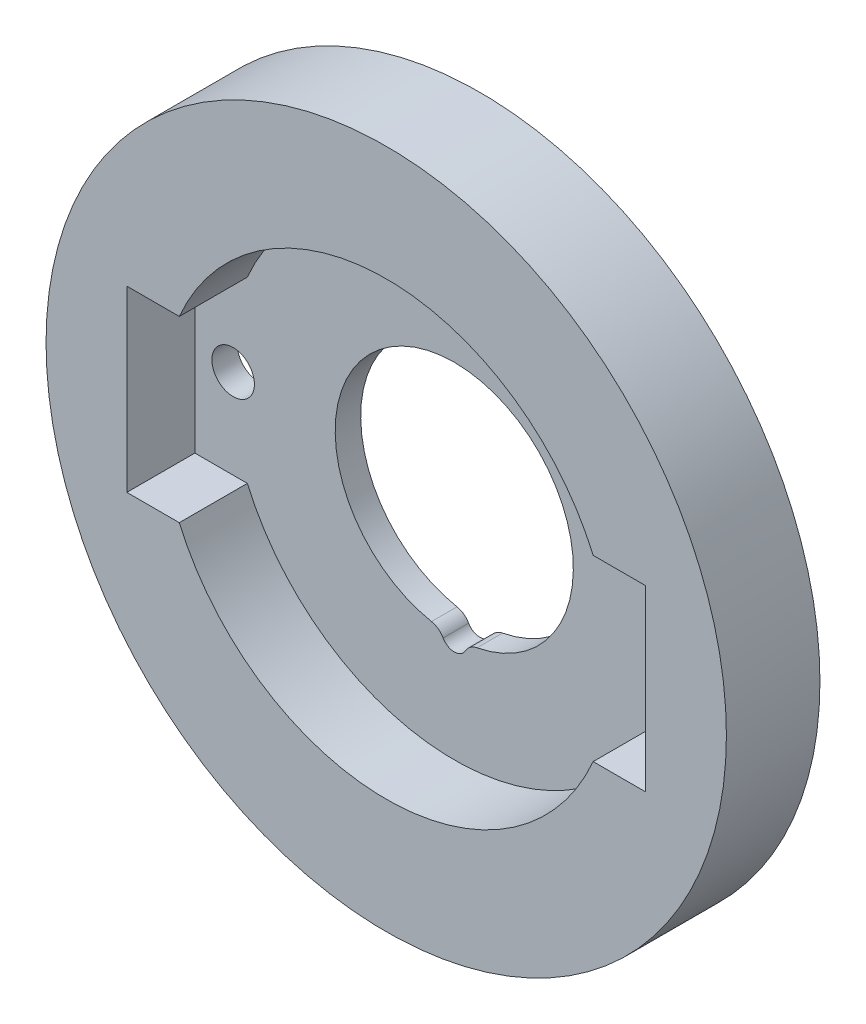
ISO-10303-21;
HEADER;
FILE_DESCRIPTION(('STEP AP214'),'2;1');
FILE_NAME('part.step','',(''),(''),'','','');
FILE_SCHEMA(('AUTOMOTIVE_DESIGN { 1 0 10303 214 1 1 1 1 }'));
ENDSEC;
DATA;
#1=APPLICATION_CONTEXT('core data for automotive mechanical design processes');
#2=APPLICATION_PROTOCOL_DEFINITION('international standard','automotive_design',2000,#1);
#3=PRODUCT_CONTEXT('',#1,'mechanical');
#4=PRODUCT('Part','Part','',(#3));
#5=PRODUCT_RELATED_PRODUCT_CATEGORY('part','',(#4));
#6=PRODUCT_DEFINITION_FORMATION('','',#4);
#7=PRODUCT_DEFINITION_CONTEXT('part definition',#1,'design');
#8=PRODUCT_DEFINITION('design','',#6,#7);
#9=PRODUCT_DEFINITION_SHAPE('','',#8);
#10=(LENGTH_UNIT() NAMED_UNIT(*) SI_UNIT(.MILLI.,.METRE.));
#11=(NAMED_UNIT(*) PLANE_ANGLE_UNIT() SI_UNIT($,.RADIAN.));
#12=(NAMED_UNIT(*) SI_UNIT($,.STERADIAN.) SOLID_ANGLE_UNIT());
#13=UNCERTAINTY_MEASURE_WITH_UNIT(LENGTH_MEASURE(1.E-05),#10,'distance_accuracy_value','');
#14=(GEOMETRIC_REPRESENTATION_CONTEXT(3) GLOBAL_UNCERTAINTY_ASSIGNED_CONTEXT((#13)) GLOBAL_UNIT_ASSIGNED_CONTEXT((#10,
#11,#12)) REPRESENTATION_CONTEXT('',''));
#15=CARTESIAN_POINT('',(0.,0.,0.));
#16=DIRECTION('',(0.,0.,1.));
#17=DIRECTION('',(1.,0.,0.));
#18=AXIS2_PLACEMENT_3D('',#15,#16,#17);
#19=CARTESIAN_POINT('',(0.,0.,0.));
#20=DIRECTION('',(0.,0.,1.));
#21=DIRECTION('',(1.,0.,0.));
#22=AXIS2_PLACEMENT_3D('',#19,#20,#21);
#23=PLANE('',#22);
#24=CARTESIAN_POINT('',(13.,0.,0.));
#25=DIRECTION('',(0.,0.,1.));
#26=DIRECTION('',(1.,0.,0.));
#27=AXIS2_PLACEMENT_3D('',#24,#25,#26);
#28=CIRCLE('',#27,1.25);
#29=CARTESIAN_POINT('',(14.25,0.,0.));
#30=VERTEX_POINT('',#29);
#31=EDGE_CURVE('E281',#30,#30,#28,.F.);
#32=ORIENTED_EDGE('',*,*,#31,.F.);
#33=EDGE_LOOP('',(#32));
#34=FACE_BOUND('',#33,.T.);
#35=CARTESIAN_POINT('',(0.,-7.,0.));
#36=DIRECTION('',(0.,0.,1.));
#37=DIRECTION('',(1.,0.,0.));
#38=AXIS2_PLACEMENT_3D('',#35,#36,#37);
#39=CIRCLE('',#38,0.75);
#40=CARTESIAN_POINT('',(0.654949028776033,-7.36543367346939,0.));
#41=VERTEX_POINT('',#40);
#42=CARTESIAN_POINT('',(-0.654949028776033,-7.36543367346939,0.));
#43=VERTEX_POINT('',#42);
#44=EDGE_CURVE('E224',#41,#43,#39,.F.);
#45=ORIENTED_EDGE('',*,*,#44,.F.);
#46=CARTESIAN_POINT('',(1.52821440047741,-7.85267857142857,0.));
#47=DIRECTION('',(0.,0.,1.));
#48=DIRECTION('',(1.,0.,0.));
#49=AXIS2_PLACEMENT_3D('',#46,#47,#48);
#50=CIRCLE('',#49,1.);
#51=CARTESIAN_POINT('',(1.33718760041773,-6.87109375,0.));
#52=VERTEX_POINT('',#51);
#53=EDGE_CURVE('E11',#41,#52,#50,.F.);
#54=ORIENTED_EDGE('',*,*,#53,.T.);
#55=CARTESIAN_POINT('',(0.,0.,0.));
#56=DIRECTION('',(0.,0.,1.));
#57=DIRECTION('',(1.,0.,0.));
#58=AXIS2_PLACEMENT_3D('',#55,#56,#57);
#59=CIRCLE('',#58,7.);
#60=CARTESIAN_POINT('',(-1.33718760041773,-6.87109375,0.));
#61=VERTEX_POINT('',#60);
#62=EDGE_CURVE('E189',#52,#61,#59,.T.);
#63=ORIENTED_EDGE('',*,*,#62,.T.);
#64=CARTESIAN_POINT('',(-1.52821440047741,-7.85267857142857,0.));
#65=DIRECTION('',(0.,0.,1.));
#66=DIRECTION('',(1.,0.,0.));
#67=AXIS2_PLACEMENT_3D('',#64,#65,#66);
#68=CIRCLE('',#67,1.);
#69=EDGE_CURVE('E41',#61,#43,#68,.F.);
#70=ORIENTED_EDGE('',*,*,#69,.T.);
#71=EDGE_LOOP('',(#45,#54,#63,#70));
#72=FACE_BOUND('',#71,.T.);
#73=CARTESIAN_POINT('',(0.,0.,0.));
#74=DIRECTION('',(0.,0.,1.));
#75=DIRECTION('',(1.,0.,0.));
#76=AXIS2_PLACEMENT_3D('',#73,#74,#75);
#77=CIRCLE('',#76,20.);
#78=CARTESIAN_POINT('',(20.,0.,0.));
#79=VERTEX_POINT('',#78);
#80=EDGE_CURVE('E202',#79,#79,#77,.T.);
#81=ORIENTED_EDGE('',*,*,#80,.F.);
#82=EDGE_LOOP('',(#81));
#83=FACE_BOUND('',#82,.T.);
#84=CARTESIAN_POINT('',(-13.,0.,0.));
#85=DIRECTION('',(0.,0.,1.));
#86=DIRECTION('',(1.,0.,0.));
#87=AXIS2_PLACEMENT_3D('',#84,#85,#86);
#88=CIRCLE('',#87,1.25);
#89=CARTESIAN_POINT('',(-11.75,0.,0.));
#90=VERTEX_POINT('',#89);
#91=EDGE_CURVE('E275',#90,#90,#88,.T.);
#92=ORIENTED_EDGE('',*,*,#91,.T.);
#93=EDGE_LOOP('',(#92));
#94=FACE_BOUND('',#93,.T.);
#95=ADVANCED_FACE('F33',(#34,#72,#83,#94),#23,.F.);
#96=CARTESIAN_POINT('',(0.,0.,1.5));
#97=DIRECTION('',(0.,0.,1.));
#98=DIRECTION('',(1.,0.,0.));
#99=AXIS2_PLACEMENT_3D('',#96,#97,#98);
#100=PLANE('',#99);
#101=CARTESIAN_POINT('',(0.,0.,1.5));
#102=DIRECTION('',(0.,0.,1.));
#103=DIRECTION('',(1.,0.,0.));
#104=AXIS2_PLACEMENT_3D('',#101,#102,#103);
#105=CIRCLE('',#104,7.);
#106=CARTESIAN_POINT('',(-1.33718760041773,-6.87109375,1.5));
#107=VERTEX_POINT('',#106);
#108=CARTESIAN_POINT('',(1.33718760041773,-6.87109375,1.5));
#109=VERTEX_POINT('',#108);
#110=EDGE_CURVE('E146',#107,#109,#105,.F.);
#111=ORIENTED_EDGE('',*,*,#110,.T.);
#112=CARTESIAN_POINT('',(1.52821440047741,-7.85267857142857,1.5));
#113=DIRECTION('',(0.,0.,1.));
#114=DIRECTION('',(1.,0.,0.));
#115=AXIS2_PLACEMENT_3D('',#112,#113,#114);
#116=CIRCLE('',#115,1.);
#117=CARTESIAN_POINT('',(0.654949028776033,-7.36543367346939,1.5));
#118=VERTEX_POINT('',#117);
#119=EDGE_CURVE('E216',#109,#118,#116,.T.);
#120=ORIENTED_EDGE('',*,*,#119,.T.);
#121=CARTESIAN_POINT('',(0.,-7.,1.5));
#122=DIRECTION('',(0.,0.,1.));
#123=DIRECTION('',(1.,0.,0.));
#124=AXIS2_PLACEMENT_3D('',#121,#122,#123);
#125=CIRCLE('',#124,0.75);
#126=CARTESIAN_POINT('',(-0.654949028776033,-7.36543367346939,1.5));
#127=VERTEX_POINT('',#126);
#128=EDGE_CURVE('E223',#127,#118,#125,.T.);
#129=ORIENTED_EDGE('',*,*,#128,.F.);
#130=CARTESIAN_POINT('',(-1.52821440047741,-7.85267857142857,1.5));
#131=DIRECTION('',(0.,0.,1.));
#132=DIRECTION('',(1.,0.,0.));
#133=AXIS2_PLACEMENT_3D('',#130,#131,#132);
#134=CIRCLE('',#133,1.);
#135=EDGE_CURVE('E214',#127,#107,#134,.T.);
#136=ORIENTED_EDGE('',*,*,#135,.T.);
#137=EDGE_LOOP('',(#111,#120,#129,#136));
#138=FACE_BOUND('',#137,.T.);
#139=CARTESIAN_POINT('',(13.,0.,1.5));
#140=DIRECTION('',(0.,0.,1.));
#141=DIRECTION('',(1.,0.,0.));
#142=AXIS2_PLACEMENT_3D('',#139,#140,#141);
#143=CIRCLE('',#142,1.25);
#144=CARTESIAN_POINT('',(14.25,0.,1.5));
#145=VERTEX_POINT('',#144);
#146=EDGE_CURVE('E277',#145,#145,#143,.F.);
#147=ORIENTED_EDGE('',*,*,#146,.T.);
#148=EDGE_LOOP('',(#147));
#149=FACE_BOUND('',#148,.T.);
#150=CARTESIAN_POINT('',(0.,0.,1.5));
#151=DIRECTION('',(0.,0.,1.));
#152=DIRECTION('',(1.,0.,0.));
#153=AXIS2_PLACEMENT_3D('',#150,#151,#152);
#154=CIRCLE('',#153,13.25);
#155=CARTESIAN_POINT('',(12.1655250605964,5.25,1.5));
#156=VERTEX_POINT('',#155);
#157=CARTESIAN_POINT('',(-12.1655250605964,5.25,1.5));
#158=VERTEX_POINT('',#157);
#159=EDGE_CURVE('E133',#156,#158,#154,.T.);
#160=ORIENTED_EDGE('',*,*,#159,.T.);
#161=DIRECTION('',(1.,0.,0.));
#162=VECTOR('',#161,1.);
#163=CARTESIAN_POINT('',(0.,5.25,1.5));
#164=LINE('',#163,#162);
#165=CARTESIAN_POINT('',(-15.25,5.25,1.5));
#166=VERTEX_POINT('',#165);
#167=EDGE_CURVE('E121',#166,#158,#164,.T.);
#168=ORIENTED_EDGE('',*,*,#167,.F.);
#169=DIRECTION('',(0.,1.,0.));
#170=VECTOR('',#169,1.);
#171=CARTESIAN_POINT('',(-15.25,0.,1.5));
#172=LINE('',#171,#170);
#173=CARTESIAN_POINT('',(-15.25,-5.25,1.5));
#174=VERTEX_POINT('',#173);
#175=EDGE_CURVE('E132',#174,#166,#172,.T.);
#176=ORIENTED_EDGE('',*,*,#175,.F.);
#177=DIRECTION('',(1.,0.,0.));
#178=VECTOR('',#177,1.);
#179=CARTESIAN_POINT('',(0.,-5.25,1.5));
#180=LINE('',#179,#178);
#181=CARTESIAN_POINT('',(-12.1655250605964,-5.25,1.5));
#182=VERTEX_POINT('',#181);
#183=EDGE_CURVE('E154',#174,#182,#180,.T.);
#184=ORIENTED_EDGE('',*,*,#183,.T.);
#185=CARTESIAN_POINT('',(0.,0.,1.5));
#186=DIRECTION('',(0.,0.,1.));
#187=DIRECTION('',(1.,0.,0.));
#188=AXIS2_PLACEMENT_3D('',#185,#186,#187);
#189=CIRCLE('',#188,13.25);
#190=CARTESIAN_POINT('',(12.1655250605964,-5.25,1.5));
#191=VERTEX_POINT('',#190);
#192=EDGE_CURVE('E157',#182,#191,#189,.T.);
#193=ORIENTED_EDGE('',*,*,#192,.T.);
#194=DIRECTION('',(1.,0.,0.));
#195=VECTOR('',#194,1.);
#196=CARTESIAN_POINT('',(0.,-5.25,1.5));
#197=LINE('',#196,#195);
#198=CARTESIAN_POINT('',(15.25,-5.25,1.5));
#199=VERTEX_POINT('',#198);
#200=EDGE_CURVE('E160',#191,#199,#197,.T.);
#201=ORIENTED_EDGE('',*,*,#200,.T.);
#202=DIRECTION('',(0.,1.,0.));
#203=VECTOR('',#202,1.);
#204=CARTESIAN_POINT('',(15.25,0.,1.5));
#205=LINE('',#204,#203);
#206=CARTESIAN_POINT('',(15.25,5.25,1.5));
#207=VERTEX_POINT('',#206);
#208=EDGE_CURVE('E163',#199,#207,#205,.T.);
#209=ORIENTED_EDGE('',*,*,#208,.T.);
#210=DIRECTION('',(1.,0.,0.));
#211=VECTOR('',#210,1.);
#212=CARTESIAN_POINT('',(0.,5.25,1.5));
#213=LINE('',#212,#211);
#214=EDGE_CURVE('E140',#156,#207,#213,.T.);
#215=ORIENTED_EDGE('',*,*,#214,.F.);
#216=EDGE_LOOP('',(#160,#168,#176,#184,#193,#201,#209,#215));
#217=FACE_BOUND('',#216,.T.);
#218=CARTESIAN_POINT('',(-13.,0.,1.5));
#219=DIRECTION('',(0.,0.,1.));
#220=DIRECTION('',(1.,0.,0.));
#221=AXIS2_PLACEMENT_3D('',#218,#219,#220);
#222=CIRCLE('',#221,1.25);
#223=CARTESIAN_POINT('',(-11.75,0.,1.5));
#224=VERTEX_POINT('',#223);
#225=EDGE_CURVE('E168',#224,#224,#222,.T.);
#226=ORIENTED_EDGE('',*,*,#225,.F.);
#227=EDGE_LOOP('',(#226));
#228=FACE_BOUND('',#227,.T.);
#229=ADVANCED_FACE('F143',(#138,#149,#217,#228),#100,.T.);
#230=CARTESIAN_POINT('',(0.,0.,5.5));
#231=DIRECTION('',(0.,0.,-1.));
#232=DIRECTION('',(-1.,0.,0.));
#233=AXIS2_PLACEMENT_3D('',#230,#231,#232);
#234=CYLINDRICAL_SURFACE('',#233,7.);
#235=ORIENTED_EDGE('',*,*,#62,.F.);
#236=DIRECTION('',(0.,0.,-1.));
#237=VECTOR('',#236,1.);
#238=CARTESIAN_POINT('',(1.33718760041773,-6.87109375,5.5));
#239=LINE('',#238,#237);
#240=EDGE_CURVE('E211',#52,#109,#239,.F.);
#241=ORIENTED_EDGE('',*,*,#240,.T.);
#242=ORIENTED_EDGE('',*,*,#110,.F.);
#243=DIRECTION('',(0.,0.,-1.));
#244=VECTOR('',#243,1.);
#245=CARTESIAN_POINT('',(-1.33718760041773,-6.87109375,5.5));
#246=LINE('',#245,#244);
#247=EDGE_CURVE('E206',#107,#61,#246,.T.);
#248=ORIENTED_EDGE('',*,*,#247,.T.);
#249=EDGE_LOOP('',(#235,#241,#242,#248));
#250=FACE_BOUND('',#249,.T.);
#251=ADVANCED_FACE('F234',(#250),#234,.F.);
#252=CARTESIAN_POINT('',(0.,0.,5.5));
#253=DIRECTION('',(0.,0.,1.));
#254=DIRECTION('',(1.,0.,0.));
#255=AXIS2_PLACEMENT_3D('',#252,#253,#254);
#256=PLANE('',#255);
#257=CARTESIAN_POINT('',(0.,0.,5.5));
#258=DIRECTION('',(0.,0.,1.));
#259=DIRECTION('',(1.,0.,0.));
#260=AXIS2_PLACEMENT_3D('',#257,#258,#259);
#261=CIRCLE('',#260,13.25);
#262=CARTESIAN_POINT('',(12.1655250605964,5.25,5.5));
#263=VERTEX_POINT('',#262);
#264=CARTESIAN_POINT('',(-12.1655250605964,5.25,5.5));
#265=VERTEX_POINT('',#264);
#266=EDGE_CURVE('E139',#263,#265,#261,.T.);
#267=ORIENTED_EDGE('',*,*,#266,.F.);
#268=DIRECTION('',(1.,0.,0.));
#269=VECTOR('',#268,1.);
#270=CARTESIAN_POINT('',(0.,5.25,5.5));
#271=LINE('',#270,#269);
#272=CARTESIAN_POINT('',(15.25,5.25,5.5));
#273=VERTEX_POINT('',#272);
#274=EDGE_CURVE('E149',#263,#273,#271,.T.);
#275=ORIENTED_EDGE('',*,*,#274,.T.);
#276=DIRECTION('',(0.,1.,0.));
#277=VECTOR('',#276,1.);
#278=CARTESIAN_POINT('',(15.25,0.,5.5));
#279=LINE('',#278,#277);
#280=CARTESIAN_POINT('',(15.25,-5.25,5.5));
#281=VERTEX_POINT('',#280);
#282=EDGE_CURVE('E182',#281,#273,#279,.T.);
#283=ORIENTED_EDGE('',*,*,#282,.F.);
#284=DIRECTION('',(1.,0.,0.));
#285=VECTOR('',#284,1.);
#286=CARTESIAN_POINT('',(0.,-5.25,5.5));
#287=LINE('',#286,#285);
#288=CARTESIAN_POINT('',(12.1655250605964,-5.25,5.5));
#289=VERTEX_POINT('',#288);
#290=EDGE_CURVE('E179',#289,#281,#287,.T.);
#291=ORIENTED_EDGE('',*,*,#290,.F.);
#292=CARTESIAN_POINT('',(0.,0.,5.5));
#293=DIRECTION('',(0.,0.,1.));
#294=DIRECTION('',(1.,0.,0.));
#295=AXIS2_PLACEMENT_3D('',#292,#293,#294);
#296=CIRCLE('',#295,13.25);
#297=CARTESIAN_POINT('',(-12.1655250605964,-5.25,5.5));
#298=VERTEX_POINT('',#297);
#299=EDGE_CURVE('E176',#298,#289,#296,.T.);
#300=ORIENTED_EDGE('',*,*,#299,.F.);
#301=DIRECTION('',(1.,0.,0.));
#302=VECTOR('',#301,1.);
#303=CARTESIAN_POINT('',(0.,-5.25,5.5));
#304=LINE('',#303,#302);
#305=CARTESIAN_POINT('',(-15.25,-5.25,5.5));
#306=VERTEX_POINT('',#305);
#307=EDGE_CURVE('E173',#306,#298,#304,.T.);
#308=ORIENTED_EDGE('',*,*,#307,.F.);
#309=DIRECTION('',(0.,1.,0.));
#310=VECTOR('',#309,1.);
#311=CARTESIAN_POINT('',(-15.25,0.,5.5));
#312=LINE('',#311,#310);
#313=CARTESIAN_POINT('',(-15.25,5.25,5.5));
#314=VERTEX_POINT('',#313);
#315=EDGE_CURVE('E170',#306,#314,#312,.T.);
#316=ORIENTED_EDGE('',*,*,#315,.T.);
#317=DIRECTION('',(1.,0.,0.));
#318=VECTOR('',#317,1.);
#319=CARTESIAN_POINT('',(0.,5.25,5.5));
#320=LINE('',#319,#318);
#321=EDGE_CURVE('E167',#314,#265,#320,.T.);
#322=ORIENTED_EDGE('',*,*,#321,.T.);
#323=EDGE_LOOP('',(#267,#275,#283,#291,#300,#308,#316,#322));
#324=FACE_BOUND('',#323,.T.);
#325=CARTESIAN_POINT('',(0.,0.,5.5));
#326=DIRECTION('',(0.,0.,1.));
#327=DIRECTION('',(1.,0.,0.));
#328=AXIS2_PLACEMENT_3D('',#325,#326,#327);
#329=CIRCLE('',#328,20.);
#330=CARTESIAN_POINT('',(20.,0.,5.5));
#331=VERTEX_POINT('',#330);
#332=EDGE_CURVE('E203',#331,#331,#329,.T.);
#333=ORIENTED_EDGE('',*,*,#332,.T.);
#334=EDGE_LOOP('',(#333));
#335=FACE_BOUND('',#334,.T.);
#336=ADVANCED_FACE('F257',(#324,#335),#256,.T.);
#337=CARTESIAN_POINT('',(0.,0.,5.5));
#338=DIRECTION('',(0.,0.,-1.));
#339=DIRECTION('',(-1.,0.,0.));
#340=AXIS2_PLACEMENT_3D('',#337,#338,#339);
#341=CYLINDRICAL_SURFACE('',#340,20.);
#342=ORIENTED_EDGE('',*,*,#332,.F.);
#343=EDGE_LOOP('',(#342));
#344=FACE_BOUND('',#343,.T.);
#345=ORIENTED_EDGE('',*,*,#80,.T.);
#346=EDGE_LOOP('',(#345));
#347=FACE_BOUND('',#346,.T.);
#348=ADVANCED_FACE('F259',(#344,#347),#341,.T.);
#349=CARTESIAN_POINT('',(0.,0.,1.5));
#350=DIRECTION('',(0.,0.,1.));
#351=DIRECTION('',(1.,0.,0.));
#352=AXIS2_PLACEMENT_3D('',#349,#350,#351);
#353=CYLINDRICAL_SURFACE('',#352,13.25);
#354=ORIENTED_EDGE('',*,*,#266,.T.);
#355=DIRECTION('',(0.,0.,1.));
#356=VECTOR('',#355,1.);
#357=CARTESIAN_POINT('',(-12.1655250605964,5.25,1.5));
#358=LINE('',#357,#356);
#359=EDGE_CURVE('E124',#158,#265,#358,.T.);
#360=ORIENTED_EDGE('',*,*,#359,.F.);
#361=ORIENTED_EDGE('',*,*,#159,.F.);
#362=DIRECTION('',(0.,0.,1.));
#363=VECTOR('',#362,1.);
#364=CARTESIAN_POINT('',(12.1655250605964,5.25,1.5));
#365=LINE('',#364,#363);
#366=EDGE_CURVE('E187',#156,#263,#365,.T.);
#367=ORIENTED_EDGE('',*,*,#366,.T.);
#368=EDGE_LOOP('',(#354,#360,#361,#367));
#369=FACE_BOUND('',#368,.T.);
#370=ADVANCED_FACE('F137',(#369),#353,.F.);
#371=CARTESIAN_POINT('',(0.,5.25,1.5));
#372=DIRECTION('',(0.,-1.,0.));
#373=DIRECTION('',(0.,0.,-1.));
#374=AXIS2_PLACEMENT_3D('',#371,#372,#373);
#375=PLANE('',#374);
#376=ORIENTED_EDGE('',*,*,#274,.F.);
#377=ORIENTED_EDGE('',*,*,#366,.F.);
#378=ORIENTED_EDGE('',*,*,#214,.T.);
#379=DIRECTION('',(0.,0.,1.));
#380=VECTOR('',#379,1.);
#381=CARTESIAN_POINT('',(15.25,5.25,1.5));
#382=LINE('',#381,#380);
#383=EDGE_CURVE('E190',#207,#273,#382,.T.);
#384=ORIENTED_EDGE('',*,*,#383,.T.);
#385=EDGE_LOOP('',(#376,#377,#378,#384));
#386=FACE_BOUND('',#385,.T.);
#387=ADVANCED_FACE('F266',(#386),#375,.T.);
#388=CARTESIAN_POINT('',(15.25,0.,1.5));
#389=DIRECTION('',(1.,0.,0.));
#390=DIRECTION('',(0.,0.,-1.));
#391=AXIS2_PLACEMENT_3D('',#388,#389,#390);
#392=PLANE('',#391);
#393=ORIENTED_EDGE('',*,*,#282,.T.);
#394=ORIENTED_EDGE('',*,*,#383,.F.);
#395=ORIENTED_EDGE('',*,*,#208,.F.);
#396=DIRECTION('',(0.,0.,1.));
#397=VECTOR('',#396,1.);
#398=CARTESIAN_POINT('',(15.25,-5.25,1.5));
#399=LINE('',#398,#397);
#400=EDGE_CURVE('E192',#199,#281,#399,.T.);
#401=ORIENTED_EDGE('',*,*,#400,.T.);
#402=EDGE_LOOP('',(#393,#394,#395,#401));
#403=FACE_BOUND('',#402,.T.);
#404=ADVANCED_FACE('F300',(#403),#392,.F.);
#405=CARTESIAN_POINT('',(0.,-5.25,1.5));
#406=DIRECTION('',(0.,-1.,0.));
#407=DIRECTION('',(0.,0.,-1.));
#408=AXIS2_PLACEMENT_3D('',#405,#406,#407);
#409=PLANE('',#408);
#410=ORIENTED_EDGE('',*,*,#290,.T.);
#411=ORIENTED_EDGE('',*,*,#400,.F.);
#412=ORIENTED_EDGE('',*,*,#200,.F.);
#413=DIRECTION('',(0.,0.,1.));
#414=VECTOR('',#413,1.);
#415=CARTESIAN_POINT('',(12.1655250605964,-5.25,1.5));
#416=LINE('',#415,#414);
#417=EDGE_CURVE('E194',#191,#289,#416,.T.);
#418=ORIENTED_EDGE('',*,*,#417,.T.);
#419=EDGE_LOOP('',(#410,#411,#412,#418));
#420=FACE_BOUND('',#419,.T.);
#421=ADVANCED_FACE('F304',(#420),#409,.F.);
#422=CARTESIAN_POINT('',(0.,0.,1.5));
#423=DIRECTION('',(0.,0.,1.));
#424=DIRECTION('',(1.,0.,0.));
#425=AXIS2_PLACEMENT_3D('',#422,#423,#424);
#426=CYLINDRICAL_SURFACE('',#425,13.25);
#427=ORIENTED_EDGE('',*,*,#299,.T.);
#428=ORIENTED_EDGE('',*,*,#417,.F.);
#429=ORIENTED_EDGE('',*,*,#192,.F.);
#430=DIRECTION('',(0.,0.,1.));
#431=VECTOR('',#430,1.);
#432=CARTESIAN_POINT('',(-12.1655250605964,-5.25,1.5));
#433=LINE('',#432,#431);
#434=EDGE_CURVE('E196',#182,#298,#433,.T.);
#435=ORIENTED_EDGE('',*,*,#434,.T.);
#436=EDGE_LOOP('',(#427,#428,#429,#435));
#437=FACE_BOUND('',#436,.T.);
#438=ADVANCED_FACE('F308',(#437),#426,.F.);
#439=CARTESIAN_POINT('',(0.,-5.25,1.5));
#440=DIRECTION('',(0.,-1.,0.));
#441=DIRECTION('',(0.,0.,-1.));
#442=AXIS2_PLACEMENT_3D('',#439,#440,#441);
#443=PLANE('',#442);
#444=ORIENTED_EDGE('',*,*,#307,.T.);
#445=ORIENTED_EDGE('',*,*,#434,.F.);
#446=ORIENTED_EDGE('',*,*,#183,.F.);
#447=DIRECTION('',(0.,0.,1.));
#448=VECTOR('',#447,1.);
#449=CARTESIAN_POINT('',(-15.25,-5.25,1.5));
#450=LINE('',#449,#448);
#451=EDGE_CURVE('E198',#174,#306,#450,.T.);
#452=ORIENTED_EDGE('',*,*,#451,.T.);
#453=EDGE_LOOP('',(#444,#445,#446,#452));
#454=FACE_BOUND('',#453,.T.);
#455=ADVANCED_FACE('F312',(#454),#443,.F.);
#456=CARTESIAN_POINT('',(-15.25,0.,1.5));
#457=DIRECTION('',(1.,0.,0.));
#458=DIRECTION('',(0.,0.,-1.));
#459=AXIS2_PLACEMENT_3D('',#456,#457,#458);
#460=PLANE('',#459);
#461=ORIENTED_EDGE('',*,*,#315,.F.);
#462=ORIENTED_EDGE('',*,*,#451,.F.);
#463=ORIENTED_EDGE('',*,*,#175,.T.);
#464=DIRECTION('',(0.,0.,1.));
#465=VECTOR('',#464,1.);
#466=CARTESIAN_POINT('',(-15.25,5.25,1.5));
#467=LINE('',#466,#465);
#468=EDGE_CURVE('E127',#166,#314,#467,.T.);
#469=ORIENTED_EDGE('',*,*,#468,.T.);
#470=EDGE_LOOP('',(#461,#462,#463,#469));
#471=FACE_BOUND('',#470,.T.);
#472=ADVANCED_FACE('F316',(#471),#460,.T.);
#473=CARTESIAN_POINT('',(0.,5.25,1.5));
#474=DIRECTION('',(0.,-1.,0.));
#475=DIRECTION('',(0.,0.,-1.));
#476=AXIS2_PLACEMENT_3D('',#473,#474,#475);
#477=PLANE('',#476);
#478=ORIENTED_EDGE('',*,*,#321,.F.);
#479=ORIENTED_EDGE('',*,*,#468,.F.);
#480=ORIENTED_EDGE('',*,*,#167,.T.);
#481=ORIENTED_EDGE('',*,*,#359,.T.);
#482=EDGE_LOOP('',(#478,#479,#480,#481));
#483=FACE_BOUND('',#482,.T.);
#484=ADVANCED_FACE('F123',(#483),#477,.T.);
#485=CARTESIAN_POINT('',(-13.,0.,-0.00100000000000013));
#486=DIRECTION('',(0.,0.,1.));
#487=DIRECTION('',(1.,0.,0.));
#488=AXIS2_PLACEMENT_3D('',#485,#486,#487);
#489=CYLINDRICAL_SURFACE('',#488,1.25);
#490=ORIENTED_EDGE('',*,*,#225,.T.);
#491=EDGE_LOOP('',(#490));
#492=FACE_BOUND('',#491,.T.);
#493=ORIENTED_EDGE('',*,*,#91,.F.);
#494=EDGE_LOOP('',(#493));
#495=FACE_BOUND('',#494,.T.);
#496=ADVANCED_FACE('F288',(#492,#495),#489,.F.);
#497=CARTESIAN_POINT('',(13.,0.,-0.00100000000000013));
#498=DIRECTION('',(0.,0.,1.));
#499=DIRECTION('',(1.,0.,0.));
#500=AXIS2_PLACEMENT_3D('',#497,#498,#499);
#501=CYLINDRICAL_SURFACE('',#500,1.25);
#502=ORIENTED_EDGE('',*,*,#146,.F.);
#503=EDGE_LOOP('',(#502));
#504=FACE_BOUND('',#503,.T.);
#505=ORIENTED_EDGE('',*,*,#31,.T.);
#506=EDGE_LOOP('',(#505));
#507=FACE_BOUND('',#506,.T.);
#508=ADVANCED_FACE('F245',(#504,#507),#501,.F.);
#509=CARTESIAN_POINT('',(0.,-7.,-0.000999999999999916));
#510=DIRECTION('',(0.,0.,1.));
#511=DIRECTION('',(1.,0.,0.));
#512=AXIS2_PLACEMENT_3D('',#509,#510,#511);
#513=CYLINDRICAL_SURFACE('',#512,0.75);
#514=ORIENTED_EDGE('',*,*,#128,.T.);
#515=DIRECTION('',(0.,0.,1.));
#516=VECTOR('',#515,1.);
#517=CARTESIAN_POINT('',(0.654949028776033,-7.36543367346939,-0.000999999999999916));
#518=LINE('',#517,#516);
#519=EDGE_CURVE('E54',#118,#41,#518,.F.);
#520=ORIENTED_EDGE('',*,*,#519,.T.);
#521=ORIENTED_EDGE('',*,*,#44,.T.);
#522=DIRECTION('',(0.,0.,1.));
#523=VECTOR('',#522,1.);
#524=CARTESIAN_POINT('',(-0.654949028776033,-7.36543367346939,-0.000999999999999916));
#525=LINE('',#524,#523);
#526=EDGE_CURVE('E218',#43,#127,#525,.T.);
#527=ORIENTED_EDGE('',*,*,#526,.T.);
#528=EDGE_LOOP('',(#514,#520,#521,#527));
#529=FACE_BOUND('',#528,.T.);
#530=ADVANCED_FACE('F222',(#529),#513,.F.);
#531=CARTESIAN_POINT('',(1.52821440047741,-7.85267857142857,-0.0010000000000001));
#532=DIRECTION('',(0.,0.,1.));
#533=DIRECTION('',(1.,0.,0.));
#534=AXIS2_PLACEMENT_3D('',#531,#532,#533);
#535=CYLINDRICAL_SURFACE('',#534,1.);
#536=ORIENTED_EDGE('',*,*,#53,.F.);
#537=ORIENTED_EDGE('',*,*,#519,.F.);
#538=ORIENTED_EDGE('',*,*,#119,.F.);
#539=ORIENTED_EDGE('',*,*,#240,.F.);
#540=EDGE_LOOP('',(#536,#537,#538,#539));
#541=FACE_BOUND('',#540,.T.);
#542=ADVANCED_FACE('F239',(#541),#535,.T.);
#543=CARTESIAN_POINT('',(-1.52821440047741,-7.85267857142857,-0.0010000000000001));
#544=DIRECTION('',(0.,0.,-1.));
#545=DIRECTION('',(-1.,0.,0.));
#546=AXIS2_PLACEMENT_3D('',#543,#544,#545);
#547=CYLINDRICAL_SURFACE('',#546,1.);
#548=ORIENTED_EDGE('',*,*,#135,.F.);
#549=ORIENTED_EDGE('',*,*,#526,.F.);
#550=ORIENTED_EDGE('',*,*,#69,.F.);
#551=ORIENTED_EDGE('',*,*,#247,.F.);
#552=EDGE_LOOP('',(#548,#549,#550,#551));
#553=FACE_BOUND('',#552,.T.);
#554=ADVANCED_FACE('F35',(#553),#547,.T.);
#555=CLOSED_SHELL('',(#95,#229,#251,#336,#348,#370,#387,#404,#421,#438,#455,#472,#484,#496,#508,
#530,#542,#554));
#556=MANIFOLD_SOLID_BREP('B2',#555);
#557=ADVANCED_BREP_SHAPE_REPRESENTATION('',(#18,#556),#14);
#558=SHAPE_DEFINITION_REPRESENTATION(#9,#557);
ENDSEC;
END-ISO-10303-21;
